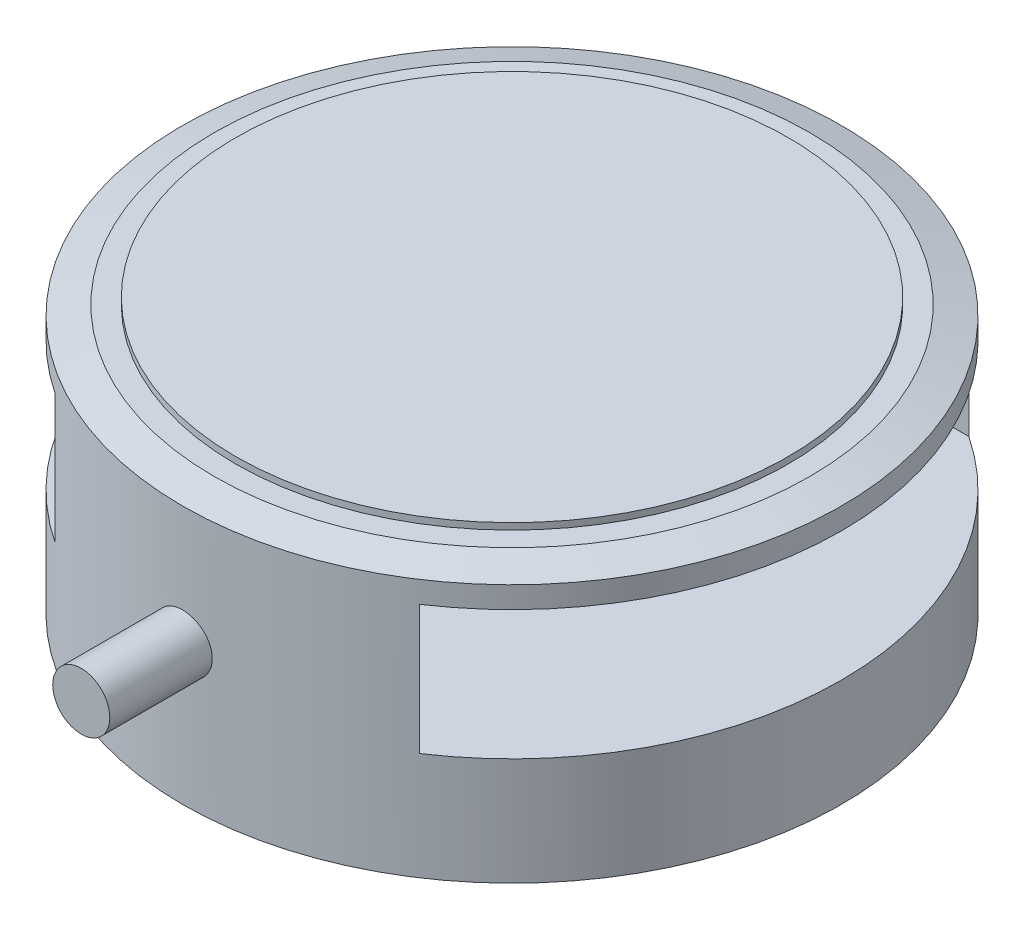
ISO-10303-21;
HEADER;
FILE_DESCRIPTION(('STEP AP214'),'2;1');
FILE_NAME('part.step','',(''),(''),'','','');
FILE_SCHEMA(('AUTOMOTIVE_DESIGN { 1 0 10303 214 1 1 1 1 }'));
ENDSEC;
DATA;
#1=APPLICATION_CONTEXT('core data for automotive mechanical design processes');
#2=APPLICATION_PROTOCOL_DEFINITION('international standard','automotive_design',2000,#1);
#3=PRODUCT_CONTEXT('',#1,'mechanical');
#4=PRODUCT('Part','Part','',(#3));
#5=PRODUCT_RELATED_PRODUCT_CATEGORY('part','',(#4));
#6=PRODUCT_DEFINITION_FORMATION('','',#4);
#7=PRODUCT_DEFINITION_CONTEXT('part definition',#1,'design');
#8=PRODUCT_DEFINITION('design','',#6,#7);
#9=PRODUCT_DEFINITION_SHAPE('','',#8);
#10=(LENGTH_UNIT() NAMED_UNIT(*) SI_UNIT(.MILLI.,.METRE.));
#11=(NAMED_UNIT(*) PLANE_ANGLE_UNIT() SI_UNIT($,.RADIAN.));
#12=(NAMED_UNIT(*) SI_UNIT($,.STERADIAN.) SOLID_ANGLE_UNIT());
#13=UNCERTAINTY_MEASURE_WITH_UNIT(LENGTH_MEASURE(1.E-05),#10,'distance_accuracy_value','');
#14=(GEOMETRIC_REPRESENTATION_CONTEXT(3) GLOBAL_UNCERTAINTY_ASSIGNED_CONTEXT((#13)) GLOBAL_UNIT_ASSIGNED_CONTEXT((#10,
#11,#12)) REPRESENTATION_CONTEXT('',''));
#15=CARTESIAN_POINT('',(0.,0.,0.));
#16=DIRECTION('',(0.,0.,1.));
#17=DIRECTION('',(1.,0.,0.));
#18=AXIS2_PLACEMENT_3D('',#15,#16,#17);
#19=CARTESIAN_POINT('',(0.,24.,0.));
#20=DIRECTION('',(0.,-1.,0.));
#21=DIRECTION('',(0.,0.,-1.));
#22=AXIS2_PLACEMENT_3D('',#19,#20,#21);
#23=CYLINDRICAL_SURFACE('',#22,30.6);
#24=DIRECTION('',(0.,-1.,0.));
#25=VECTOR('',#24,1.);
#26=CARTESIAN_POINT('',(-16.9147864308126,24.,-25.5));
#27=LINE('',#26,#25);
#28=CARTESIAN_POINT('',(-16.9147864308125,10.,-25.5));
#29=VERTEX_POINT('',#28);
#30=CARTESIAN_POINT('',(-16.9147864308126,22.,-25.5));
#31=VERTEX_POINT('',#30);
#32=EDGE_CURVE('E48',#29,#31,#27,.F.);
#33=ORIENTED_EDGE('',*,*,#32,.T.);
#34=CARTESIAN_POINT('',(0.,22.,0.));
#35=DIRECTION('',(0.,1.,0.));
#36=DIRECTION('',(0.,0.,1.));
#37=AXIS2_PLACEMENT_3D('',#34,#35,#36);
#38=CIRCLE('',#37,30.6);
#39=CARTESIAN_POINT('',(-16.9147864308126,22.,25.5));
#40=VERTEX_POINT('',#39);
#41=EDGE_CURVE('E86',#31,#40,#38,.T.);
#42=ORIENTED_EDGE('',*,*,#41,.T.);
#43=DIRECTION('',(0.,-1.,0.));
#44=VECTOR('',#43,1.);
#45=CARTESIAN_POINT('',(-16.9147864308126,24.,25.5));
#46=LINE('',#45,#44);
#47=CARTESIAN_POINT('',(-16.9147864308126,10.,25.5));
#48=VERTEX_POINT('',#47);
#49=EDGE_CURVE('E93',#40,#48,#46,.T.);
#50=ORIENTED_EDGE('',*,*,#49,.T.);
#51=CARTESIAN_POINT('',(0.,10.,0.));
#52=DIRECTION('',(0.,-1.,0.));
#53=DIRECTION('',(0.,0.,-1.));
#54=AXIS2_PLACEMENT_3D('',#51,#52,#53);
#55=CIRCLE('',#54,30.6);
#56=EDGE_CURVE('E104',#48,#29,#55,.T.);
#57=ORIENTED_EDGE('',*,*,#56,.T.);
#58=EDGE_LOOP('',(#33,#42,#50,#57));
#59=FACE_BOUND('',#58,.T.);
#60=DIRECTION('',(0.,-1.,0.));
#61=VECTOR('',#60,1.);
#62=CARTESIAN_POINT('',(16.9147864308126,24.,25.5));
#63=LINE('',#62,#61);
#64=CARTESIAN_POINT('',(16.9147864308126,10.,25.5));
#65=VERTEX_POINT('',#64);
#66=CARTESIAN_POINT('',(16.9147864308126,22.,25.5));
#67=VERTEX_POINT('',#66);
#68=EDGE_CURVE('E90',#65,#67,#63,.F.);
#69=ORIENTED_EDGE('',*,*,#68,.T.);
#70=CARTESIAN_POINT('',(16.9147864308126,22.,-25.5));
#71=VERTEX_POINT('',#70);
#72=EDGE_CURVE('E78',#67,#71,#38,.T.);
#73=ORIENTED_EDGE('',*,*,#72,.T.);
#74=DIRECTION('',(0.,-1.,0.));
#75=VECTOR('',#74,1.);
#76=CARTESIAN_POINT('',(16.9147864308126,24.,-25.5));
#77=LINE('',#76,#75);
#78=CARTESIAN_POINT('',(16.9147864308125,10.,-25.5));
#79=VERTEX_POINT('',#78);
#80=EDGE_CURVE('E99',#71,#79,#77,.T.);
#81=ORIENTED_EDGE('',*,*,#80,.T.);
#82=EDGE_CURVE('E83',#79,#65,#55,.T.);
#83=ORIENTED_EDGE('',*,*,#82,.T.);
#84=EDGE_LOOP('',(#69,#73,#81,#83));
#85=FACE_BOUND('',#84,.T.);
#86=CARTESIAN_POINT('',(0.,24.,0.));
#87=DIRECTION('',(0.,1.,0.));
#88=DIRECTION('',(0.,0.,1.));
#89=AXIS2_PLACEMENT_3D('',#86,#87,#88);
#90=CIRCLE('',#89,30.6);
#91=CARTESIAN_POINT('',(0.,24.,30.6));
#92=VERTEX_POINT('',#91);
#93=EDGE_CURVE('E112',#92,#92,#90,.T.);
#94=ORIENTED_EDGE('',*,*,#93,.F.);
#95=EDGE_LOOP('',(#94));
#96=FACE_BOUND('',#95,.T.);
#97=CARTESIAN_POINT('',(0.,0.,0.));
#98=DIRECTION('',(0.,1.,0.));
#99=DIRECTION('',(0.,0.,1.));
#100=AXIS2_PLACEMENT_3D('',#97,#98,#99);
#101=CIRCLE('',#100,30.6);
#102=CARTESIAN_POINT('',(0.,0.,30.6));
#103=VERTEX_POINT('',#102);
#104=EDGE_CURVE('E109',#103,#103,#101,.T.);
#105=ORIENTED_EDGE('',*,*,#104,.T.);
#106=EDGE_LOOP('',(#105));
#107=FACE_BOUND('',#106,.T.);
#108=CARTESIAN_POINT('',(-2.65,13.,30.48503731341));
#109=CARTESIAN_POINT('',(-2.64999352004988,12.8514480887966,30.485038833612));
#110=CARTESIAN_POINT('',(-2.63746683438908,12.7027955741363,30.4861348333021));
#111=CARTESIAN_POINT('',(-2.58768077183813,12.4096050942741,30.4904002654802));
#112=CARTESIAN_POINT('',(-2.55039351027949,12.2650719598111,30.4935720355846));
#113=CARTESIAN_POINT('',(-2.45217412823516,11.9844089630067,30.5016270954781));
#114=CARTESIAN_POINT('',(-2.39125558156434,11.8482743285003,30.5065094025789));
#115=CARTESIAN_POINT('',(-2.24752739107696,11.5881944093659,30.517434197832));
#116=CARTESIAN_POINT('',(-2.16472236676606,11.4642465600794,30.523476441087));
#117=CARTESIAN_POINT('',(-1.97932499285787,11.2316844928197,30.5360590256042));
#118=CARTESIAN_POINT('',(-1.87668465692001,11.1231085898845,30.542600551045));
#119=CARTESIAN_POINT('',(-1.65463199925895,10.9247018051141,30.5554338092435));
#120=CARTESIAN_POINT('',(-1.53521893895544,10.8348717491781,30.5617255309855));
#121=CARTESIAN_POINT('',(-1.28278064006194,10.676378043458,30.5733615985444));
#122=CARTESIAN_POINT('',(-1.14973440626409,10.6077477141939,30.5787044474317));
#123=CARTESIAN_POINT('',(-0.873952774339853,10.4938147599111,30.5878279882088));
#124=CARTESIAN_POINT('',(-0.731217557940426,10.4485116975019,30.5916087093884));
#125=CARTESIAN_POINT('',(-0.440492389120039,10.3826300202046,30.5971737265362));
#126=CARTESIAN_POINT('',(-0.292516631086049,10.3619891987131,30.5989630447181));
#127=CARTESIAN_POINT('',(0.00480905098804233,10.3458255864266,30.6003606798839));
#128=CARTESIAN_POINT('',(0.15415894758027,10.3503022950016,30.5999690403376));
#129=CARTESIAN_POINT('',(0.449571526145887,10.3841958609155,30.597053024722));
#130=CARTESIAN_POINT('',(0.595641947288711,10.4135458251685,30.594534369024));
#131=CARTESIAN_POINT('',(0.88077546847318,10.4962487158693,30.5876541470576));
#132=CARTESIAN_POINT('',(1.01983849732421,10.5496018861197,30.5832925620706));
#133=CARTESIAN_POINT('',(1.28722224110194,10.6788710219374,30.5732072628521));
#134=CARTESIAN_POINT('',(1.41552843301111,10.7548168809674,30.5674817459495));
#135=CARTESIAN_POINT('',(1.65759785727535,10.927093865208,30.5553118323462));
#136=CARTESIAN_POINT('',(1.77136077060262,11.0234254374855,30.5488674198813));
#137=CARTESIAN_POINT('',(1.98150556875637,11.2341162163664,30.5359588017621));
#138=CARTESIAN_POINT('',(2.07782917452934,11.3485335607772,30.529494600574));
#139=CARTESIAN_POINT('',(2.24991066136629,11.5919455759499,30.5172962072456));
#140=CARTESIAN_POINT('',(2.32566852344169,11.720940260171,30.5115620157795));
#141=CARTESIAN_POINT('',(2.45446616855524,11.9898868921388,30.5014719387153));
#142=CARTESIAN_POINT('',(2.50750282249939,12.129840345956,30.497116242981));
#143=CARTESIAN_POINT('',(2.58930884826128,12.4167117558205,30.4902800846809));
#144=CARTESIAN_POINT('',(2.61807877167112,12.5636295534854,30.4877995794914));
#145=CARTESIAN_POINT('',(2.65046067029809,12.8597489238087,30.4850016692355));
#146=CARTESIAN_POINT('',(2.65415396389351,13.0089415406712,30.4846772724232));
#147=CARTESIAN_POINT('',(2.63649087595541,13.3058237347121,30.4862098559258));
#148=CARTESIAN_POINT('',(2.61513474704999,13.4535133270336,30.4880668142414));
#149=CARTESIAN_POINT('',(2.54804687291288,13.7429630038589,30.4937465041726));
#150=CARTESIAN_POINT('',(2.50235316809215,13.8847319705817,30.4975661676894));
#151=CARTESIAN_POINT('',(2.38792592015923,14.1585914103458,30.5067383563901));
#152=CARTESIAN_POINT('',(2.31919197836257,14.290681715861,30.5120909080986));
#153=CARTESIAN_POINT('',(2.16042996646835,14.5418061263318,30.5237427238767));
#154=CARTESIAN_POINT('',(2.07034776255182,14.6608058949878,30.5300443795816));
#155=CARTESIAN_POINT('',(1.87152440392881,14.8820240223457,30.5428763286866));
#156=CARTESIAN_POINT('',(1.76278290266493,14.9842420692933,30.5494066263315));
#157=CARTESIAN_POINT('',(1.52937606812995,15.169273245039,30.5619809317056));
#158=CARTESIAN_POINT('',(1.40466873661637,15.2520334999934,30.5680235857606));
#159=CARTESIAN_POINT('',(1.14307915366248,15.395436853607,30.5789222144633));
#160=CARTESIAN_POINT('',(1.00619703223785,15.4560801884196,30.5837782017814));
#161=CARTESIAN_POINT('',(0.72433201988881,15.5534376768337,30.5917501513273));
#162=CARTESIAN_POINT('',(0.579360444118215,15.5901843879575,30.5948684801635));
#163=CARTESIAN_POINT('',(0.285276909710719,15.6388119064002,30.5990233902496));
#164=CARTESIAN_POINT('',(0.136165036402903,15.6506932257952,30.6000600143698));
#165=CARTESIAN_POINT('',(-0.161445508630936,15.6492465032194,30.5999347660508));
#166=CARTESIAN_POINT('',(-0.309944590585492,15.6360008036667,30.5987800746501));
#167=CARTESIAN_POINT('',(-0.602600500268666,15.5848479259135,30.5944161276903));
#168=CARTESIAN_POINT('',(-0.746757322497217,15.5469407164772,30.591206869529));
#169=CARTESIAN_POINT('',(-1.02664084987785,15.4475621539013,30.5830937715072));
#170=CARTESIAN_POINT('',(-1.1623681471511,15.3860924580588,30.5781900508314));
#171=CARTESIAN_POINT('',(-1.4215900887531,15.2413430990392,30.567236269092));
#172=CARTESIAN_POINT('',(-1.54508490414149,15.1580637409089,30.5611862240623));
#173=CARTESIAN_POINT('',(-1.77675793216278,14.9717498616612,30.5485949935007));
#174=CARTESIAN_POINT('',(-1.88488697649437,14.8686543018817,30.5420523294788));
#175=CARTESIAN_POINT('',(-2.08235155523582,14.6457472733645,30.529225849777));
#176=CARTESIAN_POINT('',(-2.17168253987217,14.5259317694722,30.5229420970579));
#177=CARTESIAN_POINT('',(-2.32914651555585,14.2727354020411,30.5113313722075));
#178=CARTESIAN_POINT('',(-2.39723690468108,14.139327978961,30.5060063318763));
#179=CARTESIAN_POINT('',(-2.50996313530727,13.8630176084951,30.4969393993027));
#180=CARTESIAN_POINT('',(-2.55462584980639,13.7201257533199,30.4931956941352));
#181=CARTESIAN_POINT('',(-2.60789688069042,13.4803307453148,30.4886747330348));
#182=CARTESIAN_POINT('',(-2.6236644560906,13.3849682486201,30.4873170036374));
#183=CARTESIAN_POINT('',(-2.64471810639669,13.1930846687503,30.4854978010546));
#184=CARTESIAN_POINT('',(-2.65000421217899,13.096563588989,30.4850363252291));
#185=CARTESIAN_POINT('',(-2.65,13.,30.48503731341));
#186=B_SPLINE_CURVE_WITH_KNOTS('',3,(#108,#109,#110,#111,#112,#113,#114,#115,#116,#117,#118,
#119,#120,#121,#122,#123,#124,#125,#126,#127,#128,#129,#130,#131,#132,#133,#134,#135,#136,#137,
#138,#139,#140,#141,#142,#143,#144,#145,#146,#147,#148,#149,#150,#151,#152,#153,#154,#155,#156,
#157,#158,#159,#160,#161,#162,#163,#164,#165,#166,#167,#168,#169,#170,#171,#172,#173,#174,#175,
#176,#177,#178,#179,#180,#181,#182,#183,#184,#185),.UNSPECIFIED.,.T.,.F.,(4,2,2,2,2,2,2,2,2,2,2,
2,2,2,2,2,2,2,2,2,2,2,2,2,2,2,2,2,2,2,2,2,2,2,2,2,2,2,4),(0.,0.445303150860838,
0.891108642097365,1.33665844084115,1.78211427387074,2.22866157552612,2.67522854688446,
3.12249387669286,3.56975081989079,4.01587723042013,4.46199474901355,4.90691629141792,
5.3518423530292,5.79735975595108,6.24288693026329,6.6898765488546,7.13686658015494,
7.58391814975656,8.03095955743037,8.47655060603176,8.9221371608032,9.36702928459701,
9.81192910712827,10.2579693880435,10.7040179541205,11.1512649368504,11.5985071439625,
12.0451387302915,12.4917611186296,12.9369224323879,13.3820843099803,13.8272148822977,
14.2723392290076,14.7188572981833,15.1654833160184,15.6129994490183,16.0600011244421,
16.3494635538204,16.6389251304968),.UNSPECIFIED.);
#187=CARTESIAN_POINT('',(-2.65,13.,30.48503731341));
#188=VERTEX_POINT('',#187);
#189=EDGE_CURVE('E11',#188,#188,#186,.T.);
#190=ORIENTED_EDGE('',*,*,#189,.F.);
#191=EDGE_LOOP('',(#190));
#192=FACE_BOUND('',#191,.T.);
#193=ADVANCED_FACE('F36',(#59,#85,#96,#107,#192),#23,.T.);
#194=CARTESIAN_POINT('',(0.,0.,0.));
#195=DIRECTION('',(0.,1.,0.));
#196=DIRECTION('',(0.,0.,1.));
#197=AXIS2_PLACEMENT_3D('',#194,#195,#196);
#198=PLANE('',#197);
#199=ORIENTED_EDGE('',*,*,#104,.F.);
#200=EDGE_LOOP('',(#199));
#201=FACE_BOUND('',#200,.T.);
#202=ADVANCED_FACE('F140',(#201),#198,.F.);
#203=CARTESIAN_POINT('',(0.,24.,0.));
#204=DIRECTION('',(0.,-1.,0.));
#205=DIRECTION('',(0.,0.,1.));
#206=AXIS2_PLACEMENT_3D('',#203,#204,#205);
#207=CONICAL_SURFACE('',#206,30.6,1.27409035395586);
#208=CARTESIAN_POINT('',(0.,24.9,0.));
#209=DIRECTION('',(0.,1.,0.));
#210=DIRECTION('',(0.,0.,1.));
#211=AXIS2_PLACEMENT_3D('',#208,#209,#210);
#212=CIRCLE('',#211,27.6562326433642);
#213=CARTESIAN_POINT('',(0.,24.9,27.6562326433642));
#214=VERTEX_POINT('',#213);
#215=EDGE_CURVE('E113',#214,#214,#212,.T.);
#216=ORIENTED_EDGE('',*,*,#215,.F.);
#217=EDGE_LOOP('',(#216));
#218=FACE_BOUND('',#217,.T.);
#219=ORIENTED_EDGE('',*,*,#93,.T.);
#220=EDGE_LOOP('',(#219));
#221=FACE_BOUND('',#220,.T.);
#222=ADVANCED_FACE('F144',(#218,#221),#207,.T.);
#223=CARTESIAN_POINT('',(0.,24.9,0.));
#224=DIRECTION('',(0.,1.,0.));
#225=DIRECTION('',(0.,0.,1.));
#226=AXIS2_PLACEMENT_3D('',#223,#224,#225);
#227=PLANE('',#226);
#228=CARTESIAN_POINT('',(0.,24.9,0.));
#229=DIRECTION('',(0.,1.,0.));
#230=DIRECTION('',(0.,0.,1.));
#231=AXIS2_PLACEMENT_3D('',#228,#229,#230);
#232=CIRCLE('',#231,25.6562326433642);
#233=CARTESIAN_POINT('',(0.,24.9,25.6562326433642));
#234=VERTEX_POINT('',#233);
#235=EDGE_CURVE('E84',#234,#234,#232,.T.);
#236=ORIENTED_EDGE('',*,*,#235,.F.);
#237=EDGE_LOOP('',(#236));
#238=FACE_BOUND('',#237,.T.);
#239=ORIENTED_EDGE('',*,*,#215,.T.);
#240=EDGE_LOOP('',(#239));
#241=FACE_BOUND('',#240,.T.);
#242=ADVANCED_FACE('F149',(#238,#241),#227,.T.);
#243=CARTESIAN_POINT('',(0.,25.5,0.));
#244=DIRECTION('',(0.,-1.,0.));
#245=DIRECTION('',(0.,0.,-1.));
#246=AXIS2_PLACEMENT_3D('',#243,#244,#245);
#247=CYLINDRICAL_SURFACE('',#246,25.6562326433642);
#248=CARTESIAN_POINT('',(0.,25.5,0.));
#249=DIRECTION('',(0.,1.,0.));
#250=DIRECTION('',(0.,0.,1.));
#251=AXIS2_PLACEMENT_3D('',#248,#249,#250);
#252=CIRCLE('',#251,25.6562326433642);
#253=CARTESIAN_POINT('',(0.,25.5,25.6562326433642));
#254=VERTEX_POINT('',#253);
#255=EDGE_CURVE('E118',#254,#254,#252,.T.);
#256=ORIENTED_EDGE('',*,*,#255,.F.);
#257=EDGE_LOOP('',(#256));
#258=FACE_BOUND('',#257,.T.);
#259=ORIENTED_EDGE('',*,*,#235,.T.);
#260=EDGE_LOOP('',(#259));
#261=FACE_BOUND('',#260,.T.);
#262=ADVANCED_FACE('F156',(#258,#261),#247,.T.);
#263=CARTESIAN_POINT('',(0.,25.5,0.));
#264=DIRECTION('',(0.,1.,0.));
#265=DIRECTION('',(0.,0.,1.));
#266=AXIS2_PLACEMENT_3D('',#263,#264,#265);
#267=PLANE('',#266);
#268=ORIENTED_EDGE('',*,*,#255,.T.);
#269=EDGE_LOOP('',(#268));
#270=FACE_BOUND('',#269,.T.);
#271=ADVANCED_FACE('F160',(#270),#267,.T.);
#272=CARTESIAN_POINT('',(-30.6,10.,-25.5));
#273=DIRECTION('',(0.,0.,-1.));
#274=DIRECTION('',(0.,1.,0.));
#275=AXIS2_PLACEMENT_3D('',#272,#273,#274);
#276=PLANE('',#275);
#277=DIRECTION('',(1.,0.,0.));
#278=VECTOR('',#277,1.);
#279=CARTESIAN_POINT('',(-30.6,22.,-25.5));
#280=LINE('',#279,#278);
#281=EDGE_CURVE('E60',#31,#71,#280,.T.);
#282=ORIENTED_EDGE('',*,*,#281,.F.);
#283=ORIENTED_EDGE('',*,*,#32,.F.);
#284=DIRECTION('',(1.,0.,0.));
#285=VECTOR('',#284,1.);
#286=CARTESIAN_POINT('',(-30.6,10.,-25.5));
#287=LINE('',#286,#285);
#288=EDGE_CURVE('E123',#29,#79,#287,.T.);
#289=ORIENTED_EDGE('',*,*,#288,.T.);
#290=ORIENTED_EDGE('',*,*,#80,.F.);
#291=EDGE_LOOP('',(#282,#283,#289,#290));
#292=FACE_BOUND('',#291,.T.);
#293=ADVANCED_FACE('F164',(#292),#276,.F.);
#294=CARTESIAN_POINT('',(-30.6,10.,25.5));
#295=DIRECTION('',(0.,-1.,0.));
#296=DIRECTION('',(0.,0.,-1.));
#297=AXIS2_PLACEMENT_3D('',#294,#295,#296);
#298=PLANE('',#297);
#299=ORIENTED_EDGE('',*,*,#288,.F.);
#300=ORIENTED_EDGE('',*,*,#56,.F.);
#301=DIRECTION('',(1.,0.,0.));
#302=VECTOR('',#301,1.);
#303=CARTESIAN_POINT('',(-30.6,10.,25.5));
#304=LINE('',#303,#302);
#305=EDGE_CURVE('E95',#48,#65,#304,.T.);
#306=ORIENTED_EDGE('',*,*,#305,.T.);
#307=ORIENTED_EDGE('',*,*,#82,.F.);
#308=EDGE_LOOP('',(#299,#300,#306,#307));
#309=FACE_BOUND('',#308,.T.);
#310=ADVANCED_FACE('F168',(#309),#298,.F.);
#311=CARTESIAN_POINT('',(-30.6,22.,25.5));
#312=DIRECTION('',(0.,0.,1.));
#313=DIRECTION('',(0.,-1.,0.));
#314=AXIS2_PLACEMENT_3D('',#311,#312,#313);
#315=PLANE('',#314);
#316=DIRECTION('',(1.,0.,0.));
#317=VECTOR('',#316,1.);
#318=CARTESIAN_POINT('',(-30.6,22.,25.5));
#319=LINE('',#318,#317);
#320=EDGE_CURVE('E55',#40,#67,#319,.T.);
#321=ORIENTED_EDGE('',*,*,#320,.T.);
#322=ORIENTED_EDGE('',*,*,#68,.F.);
#323=ORIENTED_EDGE('',*,*,#305,.F.);
#324=ORIENTED_EDGE('',*,*,#49,.F.);
#325=EDGE_LOOP('',(#321,#322,#323,#324));
#326=FACE_BOUND('',#325,.T.);
#327=ADVANCED_FACE('F88',(#326),#315,.F.);
#328=CARTESIAN_POINT('',(-30.6,22.,-25.5));
#329=DIRECTION('',(0.,1.,0.));
#330=DIRECTION('',(0.,0.,1.));
#331=AXIS2_PLACEMENT_3D('',#328,#329,#330);
#332=PLANE('',#331);
#333=ORIENTED_EDGE('',*,*,#320,.F.);
#334=ORIENTED_EDGE('',*,*,#41,.F.);
#335=ORIENTED_EDGE('',*,*,#281,.T.);
#336=ORIENTED_EDGE('',*,*,#72,.F.);
#337=EDGE_LOOP('',(#333,#334,#335,#336));
#338=FACE_BOUND('',#337,.T.);
#339=ADVANCED_FACE('F79',(#338),#332,.F.);
#340=CARTESIAN_POINT('',(0.,13.,40.));
#341=DIRECTION('',(0.,0.,-1.));
#342=DIRECTION('',(-1.,0.,0.));
#343=AXIS2_PLACEMENT_3D('',#340,#341,#342);
#344=CYLINDRICAL_SURFACE('',#343,2.65);
#345=CARTESIAN_POINT('',(0.,13.,40.));
#346=DIRECTION('',(0.,0.,1.));
#347=DIRECTION('',(1.,0.,0.));
#348=AXIS2_PLACEMENT_3D('',#345,#346,#347);
#349=CIRCLE('',#348,2.65);
#350=CARTESIAN_POINT('',(2.65,13.,40.));
#351=VERTEX_POINT('',#350);
#352=EDGE_CURVE('E124',#351,#351,#349,.T.);
#353=ORIENTED_EDGE('',*,*,#352,.F.);
#354=EDGE_LOOP('',(#353));
#355=FACE_BOUND('',#354,.T.);
#356=ORIENTED_EDGE('',*,*,#189,.T.);
#357=EDGE_LOOP('',(#356));
#358=FACE_BOUND('',#357,.T.);
#359=ADVANCED_FACE('F134',(#355,#358),#344,.T.);
#360=CARTESIAN_POINT('',(0.,13.,40.));
#361=DIRECTION('',(0.,0.,1.));
#362=DIRECTION('',(1.,0.,0.));
#363=AXIS2_PLACEMENT_3D('',#360,#361,#362);
#364=PLANE('',#363);
#365=ORIENTED_EDGE('',*,*,#352,.T.);
#366=EDGE_LOOP('',(#365));
#367=FACE_BOUND('',#366,.T.);
#368=ADVANCED_FACE('F132',(#367),#364,.T.);
#369=CLOSED_SHELL('',(#193,#202,#222,#242,#262,#271,#293,#310,#327,#339,#359,#368));
#370=MANIFOLD_SOLID_BREP('B2',#369);
#371=ADVANCED_BREP_SHAPE_REPRESENTATION('',(#18,#370),#14);
#372=SHAPE_DEFINITION_REPRESENTATION(#9,#371);
ENDSEC;
END-ISO-10303-21;
